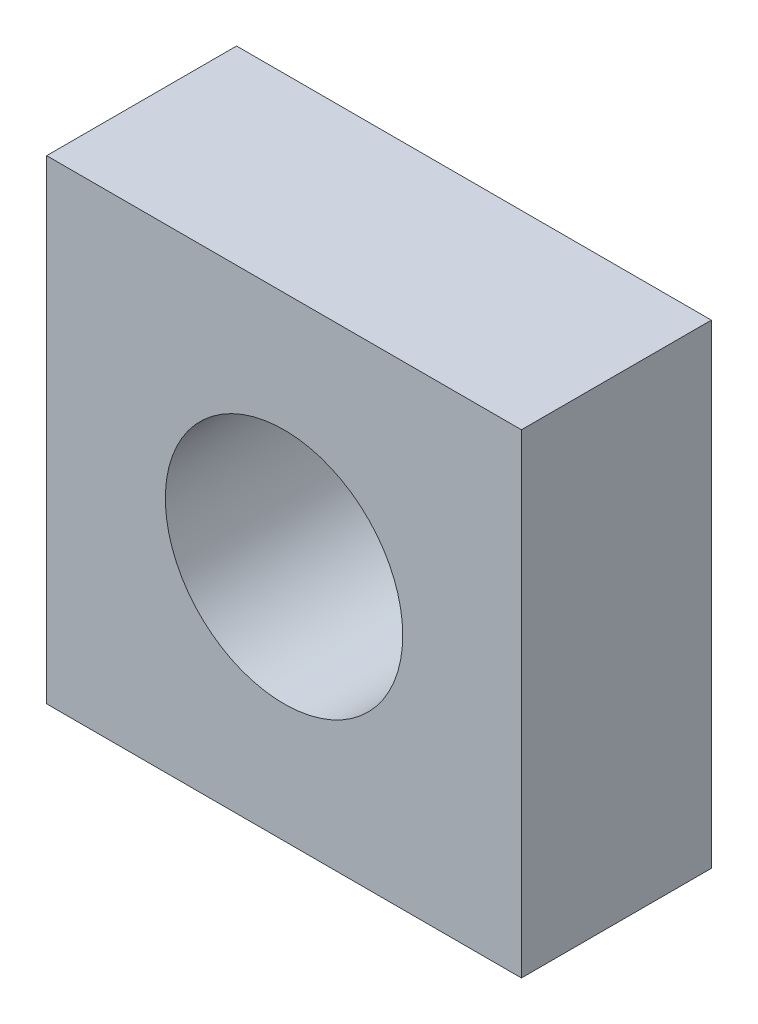
ISO-10303-21;
HEADER;
FILE_DESCRIPTION(('STEP AP214'),'2;1');
FILE_NAME('part.step','',(''),(''),'','','');
FILE_SCHEMA(('AUTOMOTIVE_DESIGN { 1 0 10303 214 1 1 1 1 }'));
ENDSEC;
DATA;
#1=APPLICATION_CONTEXT('core data for automotive mechanical design processes');
#2=APPLICATION_PROTOCOL_DEFINITION('international standard','automotive_design',2000,#1);
#3=PRODUCT_CONTEXT('',#1,'mechanical');
#4=PRODUCT('Part','Part','',(#3));
#5=PRODUCT_RELATED_PRODUCT_CATEGORY('part','',(#4));
#6=PRODUCT_DEFINITION_FORMATION('','',#4);
#7=PRODUCT_DEFINITION_CONTEXT('part definition',#1,'design');
#8=PRODUCT_DEFINITION('design','',#6,#7);
#9=PRODUCT_DEFINITION_SHAPE('','',#8);
#10=(LENGTH_UNIT() NAMED_UNIT(*) SI_UNIT(.MILLI.,.METRE.));
#11=(NAMED_UNIT(*) PLANE_ANGLE_UNIT() SI_UNIT($,.RADIAN.));
#12=(NAMED_UNIT(*) SI_UNIT($,.STERADIAN.) SOLID_ANGLE_UNIT());
#13=UNCERTAINTY_MEASURE_WITH_UNIT(LENGTH_MEASURE(1.E-05),#10,'distance_accuracy_value','');
#14=(GEOMETRIC_REPRESENTATION_CONTEXT(3) GLOBAL_UNCERTAINTY_ASSIGNED_CONTEXT((#13)) GLOBAL_UNIT_ASSIGNED_CONTEXT((#10,
#11,#12)) REPRESENTATION_CONTEXT('',''));
#15=CARTESIAN_POINT('',(0.,0.,0.));
#16=DIRECTION('',(0.,0.,1.));
#17=DIRECTION('',(1.,0.,0.));
#18=AXIS2_PLACEMENT_3D('',#15,#16,#17);
#19=CARTESIAN_POINT('',(5.,5.,4.));
#20=DIRECTION('',(-1.,0.,0.));
#21=DIRECTION('',(0.,-1.,0.));
#22=AXIS2_PLACEMENT_3D('',#19,#20,#21);
#23=PLANE('',#22);
#24=DIRECTION('',(0.,1.,0.));
#25=VECTOR('',#24,1.);
#26=CARTESIAN_POINT('',(5.,5.,0.));
#27=LINE('',#26,#25);
#28=CARTESIAN_POINT('',(5.,-5.,0.));
#29=VERTEX_POINT('',#28);
#30=CARTESIAN_POINT('',(5.,5.,0.));
#31=VERTEX_POINT('',#30);
#32=EDGE_CURVE('E113',#29,#31,#27,.T.);
#33=ORIENTED_EDGE('',*,*,#32,.T.);
#34=DIRECTION('',(0.,0.,-1.));
#35=VECTOR('',#34,1.);
#36=CARTESIAN_POINT('',(5.,5.,4.));
#37=LINE('',#36,#35);
#38=CARTESIAN_POINT('',(5.,5.,4.));
#39=VERTEX_POINT('',#38);
#40=EDGE_CURVE('E11',#39,#31,#37,.T.);
#41=ORIENTED_EDGE('',*,*,#40,.F.);
#42=DIRECTION('',(0.,1.,0.));
#43=VECTOR('',#42,1.);
#44=CARTESIAN_POINT('',(5.,5.,4.));
#45=LINE('',#44,#43);
#46=CARTESIAN_POINT('',(5.,-5.,4.));
#47=VERTEX_POINT('',#46);
#48=EDGE_CURVE('E97',#47,#39,#45,.T.);
#49=ORIENTED_EDGE('',*,*,#48,.F.);
#50=DIRECTION('',(0.,0.,-1.));
#51=VECTOR('',#50,1.);
#52=CARTESIAN_POINT('',(5.,-5.,4.));
#53=LINE('',#52,#51);
#54=EDGE_CURVE('E109',#47,#29,#53,.T.);
#55=ORIENTED_EDGE('',*,*,#54,.T.);
#56=EDGE_LOOP('',(#33,#41,#49,#55));
#57=FACE_BOUND('',#56,.T.);
#58=ADVANCED_FACE('F45',(#57),#23,.F.);
#59=CARTESIAN_POINT('',(-5.,5.,4.));
#60=DIRECTION('',(0.,-1.,0.));
#61=DIRECTION('',(0.,0.,-1.));
#62=AXIS2_PLACEMENT_3D('',#59,#60,#61);
#63=PLANE('',#62);
#64=DIRECTION('',(-1.,0.,0.));
#65=VECTOR('',#64,1.);
#66=CARTESIAN_POINT('',(-5.,5.,0.));
#67=LINE('',#66,#65);
#68=CARTESIAN_POINT('',(-5.,5.,0.));
#69=VERTEX_POINT('',#68);
#70=EDGE_CURVE('E102',#31,#69,#67,.T.);
#71=ORIENTED_EDGE('',*,*,#70,.T.);
#72=DIRECTION('',(0.,0.,-1.));
#73=VECTOR('',#72,1.);
#74=CARTESIAN_POINT('',(-5.,5.,4.));
#75=LINE('',#74,#73);
#76=CARTESIAN_POINT('',(-5.,5.,4.));
#77=VERTEX_POINT('',#76);
#78=EDGE_CURVE('E54',#77,#69,#75,.T.);
#79=ORIENTED_EDGE('',*,*,#78,.F.);
#80=DIRECTION('',(-1.,0.,0.));
#81=VECTOR('',#80,1.);
#82=CARTESIAN_POINT('',(-5.,5.,4.));
#83=LINE('',#82,#81);
#84=EDGE_CURVE('E92',#39,#77,#83,.T.);
#85=ORIENTED_EDGE('',*,*,#84,.F.);
#86=ORIENTED_EDGE('',*,*,#40,.T.);
#87=EDGE_LOOP('',(#71,#79,#85,#86));
#88=FACE_BOUND('',#87,.T.);
#89=ADVANCED_FACE('F101',(#88),#63,.F.);
#90=CARTESIAN_POINT('',(-5.,5.,4.));
#91=DIRECTION('',(1.,0.,0.));
#92=DIRECTION('',(0.,1.,0.));
#93=AXIS2_PLACEMENT_3D('',#90,#91,#92);
#94=PLANE('',#93);
#95=DIRECTION('',(0.,-1.,0.));
#96=VECTOR('',#95,1.);
#97=CARTESIAN_POINT('',(-5.,5.,0.));
#98=LINE('',#97,#96);
#99=CARTESIAN_POINT('',(-5.,-5.,0.));
#100=VERTEX_POINT('',#99);
#101=EDGE_CURVE('E79',#69,#100,#98,.T.);
#102=ORIENTED_EDGE('',*,*,#101,.T.);
#103=DIRECTION('',(0.,0.,-1.));
#104=VECTOR('',#103,1.);
#105=CARTESIAN_POINT('',(-5.,-5.,4.));
#106=LINE('',#105,#104);
#107=CARTESIAN_POINT('',(-5.,-5.,4.));
#108=VERTEX_POINT('',#107);
#109=EDGE_CURVE('E104',#108,#100,#106,.T.);
#110=ORIENTED_EDGE('',*,*,#109,.F.);
#111=DIRECTION('',(0.,-1.,0.));
#112=VECTOR('',#111,1.);
#113=CARTESIAN_POINT('',(-5.,5.,4.));
#114=LINE('',#113,#112);
#115=EDGE_CURVE('E95',#77,#108,#114,.T.);
#116=ORIENTED_EDGE('',*,*,#115,.F.);
#117=ORIENTED_EDGE('',*,*,#78,.T.);
#118=EDGE_LOOP('',(#102,#110,#116,#117));
#119=FACE_BOUND('',#118,.T.);
#120=ADVANCED_FACE('F105',(#119),#94,.F.);
#121=CARTESIAN_POINT('',(-5.,-5.,4.));
#122=DIRECTION('',(0.,1.,0.));
#123=DIRECTION('',(0.,0.,1.));
#124=AXIS2_PLACEMENT_3D('',#121,#122,#123);
#125=PLANE('',#124);
#126=DIRECTION('',(1.,0.,0.));
#127=VECTOR('',#126,1.);
#128=CARTESIAN_POINT('',(-5.,-5.,0.));
#129=LINE('',#128,#127);
#130=EDGE_CURVE('E85',#100,#29,#129,.T.);
#131=ORIENTED_EDGE('',*,*,#130,.T.);
#132=ORIENTED_EDGE('',*,*,#54,.F.);
#133=DIRECTION('',(1.,0.,0.));
#134=VECTOR('',#133,1.);
#135=CARTESIAN_POINT('',(-5.,-5.,4.));
#136=LINE('',#135,#134);
#137=EDGE_CURVE('E62',#108,#47,#136,.T.);
#138=ORIENTED_EDGE('',*,*,#137,.F.);
#139=ORIENTED_EDGE('',*,*,#109,.T.);
#140=EDGE_LOOP('',(#131,#132,#138,#139));
#141=FACE_BOUND('',#140,.T.);
#142=ADVANCED_FACE('F127',(#141),#125,.F.);
#143=CARTESIAN_POINT('',(0.,0.,4.));
#144=DIRECTION('',(0.,0.,1.));
#145=DIRECTION('',(1.,0.,0.));
#146=AXIS2_PLACEMENT_3D('',#143,#144,#145);
#147=PLANE('',#146);
#148=CARTESIAN_POINT('',(0.,0.,4.));
#149=DIRECTION('',(0.,0.,1.));
#150=DIRECTION('',(1.,0.,0.));
#151=AXIS2_PLACEMENT_3D('',#148,#149,#150);
#152=CIRCLE('',#151,2.5);
#153=CARTESIAN_POINT('',(2.5,0.,4.));
#154=VERTEX_POINT('',#153);
#155=EDGE_CURVE('E134',#154,#154,#152,.T.);
#156=ORIENTED_EDGE('',*,*,#155,.F.);
#157=EDGE_LOOP('',(#156));
#158=FACE_BOUND('',#157,.T.);
#159=ORIENTED_EDGE('',*,*,#48,.T.);
#160=ORIENTED_EDGE('',*,*,#84,.T.);
#161=ORIENTED_EDGE('',*,*,#115,.T.);
#162=ORIENTED_EDGE('',*,*,#137,.T.);
#163=EDGE_LOOP('',(#159,#160,#161,#162));
#164=FACE_BOUND('',#163,.T.);
#165=ADVANCED_FACE('F93',(#158,#164),#147,.T.);
#166=CARTESIAN_POINT('',(0.,0.,0.));
#167=DIRECTION('',(0.,0.,1.));
#168=DIRECTION('',(1.,0.,0.));
#169=AXIS2_PLACEMENT_3D('',#166,#167,#168);
#170=PLANE('',#169);
#171=CARTESIAN_POINT('',(0.,0.,0.));
#172=DIRECTION('',(0.,0.,1.));
#173=DIRECTION('',(1.,0.,0.));
#174=AXIS2_PLACEMENT_3D('',#171,#172,#173);
#175=CIRCLE('',#174,2.5);
#176=CARTESIAN_POINT('',(2.5,0.,0.));
#177=VERTEX_POINT('',#176);
#178=EDGE_CURVE('E117',#177,#177,#175,.T.);
#179=ORIENTED_EDGE('',*,*,#178,.T.);
#180=EDGE_LOOP('',(#179));
#181=FACE_BOUND('',#180,.T.);
#182=ORIENTED_EDGE('',*,*,#32,.F.);
#183=ORIENTED_EDGE('',*,*,#130,.F.);
#184=ORIENTED_EDGE('',*,*,#101,.F.);
#185=ORIENTED_EDGE('',*,*,#70,.F.);
#186=EDGE_LOOP('',(#182,#183,#184,#185));
#187=FACE_BOUND('',#186,.T.);
#188=ADVANCED_FACE('F130',(#181,#187),#170,.F.);
#189=CARTESIAN_POINT('',(0.,0.,0.));
#190=DIRECTION('',(0.,0.,1.));
#191=DIRECTION('',(1.,0.,0.));
#192=AXIS2_PLACEMENT_3D('',#189,#190,#191);
#193=CYLINDRICAL_SURFACE('',#192,2.5);
#194=ORIENTED_EDGE('',*,*,#178,.F.);
#195=EDGE_LOOP('',(#194));
#196=FACE_BOUND('',#195,.T.);
#197=ORIENTED_EDGE('',*,*,#155,.T.);
#198=EDGE_LOOP('',(#197));
#199=FACE_BOUND('',#198,.T.);
#200=ADVANCED_FACE('F143',(#196,#199),#193,.F.);
#201=CLOSED_SHELL('',(#58,#89,#120,#142,#165,#188,#200));
#202=MANIFOLD_SOLID_BREP('B2',#201);
#203=ADVANCED_BREP_SHAPE_REPRESENTATION('',(#18,#202),#14);
#204=SHAPE_DEFINITION_REPRESENTATION(#9,#203);
ENDSEC;
END-ISO-10303-21;
